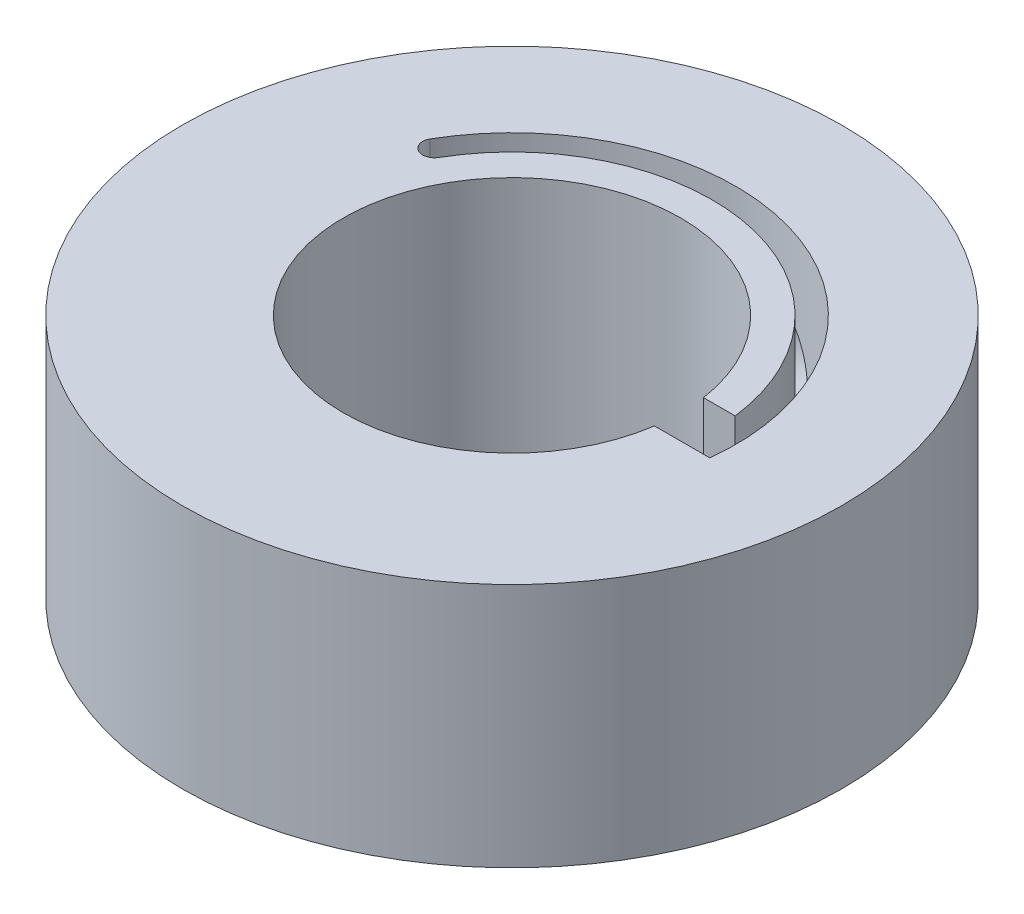
ISO-10303-21;
HEADER;
FILE_DESCRIPTION(('STEP AP214'),'2;1');
FILE_NAME('part.step','',(''),(''),'','','');
FILE_SCHEMA(('AUTOMOTIVE_DESIGN { 1 0 10303 214 1 1 1 1 }'));
ENDSEC;
DATA;
#1=APPLICATION_CONTEXT('core data for automotive mechanical design processes');
#2=APPLICATION_PROTOCOL_DEFINITION('international standard','automotive_design',2000,#1);
#3=PRODUCT_CONTEXT('',#1,'mechanical');
#4=PRODUCT('Part','Part','',(#3));
#5=PRODUCT_RELATED_PRODUCT_CATEGORY('part','',(#4));
#6=PRODUCT_DEFINITION_FORMATION('','',#4);
#7=PRODUCT_DEFINITION_CONTEXT('part definition',#1,'design');
#8=PRODUCT_DEFINITION('design','',#6,#7);
#9=PRODUCT_DEFINITION_SHAPE('','',#8);
#10=(LENGTH_UNIT() NAMED_UNIT(*) SI_UNIT(.MILLI.,.METRE.));
#11=(NAMED_UNIT(*) PLANE_ANGLE_UNIT() SI_UNIT($,.RADIAN.));
#12=(NAMED_UNIT(*) SI_UNIT($,.STERADIAN.) SOLID_ANGLE_UNIT());
#13=UNCERTAINTY_MEASURE_WITH_UNIT(LENGTH_MEASURE(1.E-05),#10,'distance_accuracy_value','');
#14=(GEOMETRIC_REPRESENTATION_CONTEXT(3) GLOBAL_UNCERTAINTY_ASSIGNED_CONTEXT((#13)) GLOBAL_UNIT_ASSIGNED_CONTEXT((#10,
#11,#12)) REPRESENTATION_CONTEXT('',''));
#15=CARTESIAN_POINT('',(0.,0.,0.));
#16=DIRECTION('',(0.,0.,1.));
#17=DIRECTION('',(1.,0.,0.));
#18=AXIS2_PLACEMENT_3D('',#15,#16,#17);
#19=CARTESIAN_POINT('',(0.,7.9375,0.));
#20=DIRECTION('',(0.,1.,0.));
#21=DIRECTION('',(0.,0.,1.));
#22=AXIS2_PLACEMENT_3D('',#19,#20,#21);
#23=PLANE('',#22);
#24=CARTESIAN_POINT('',(0.,7.9375,0.));
#25=DIRECTION('',(0.,1.,0.));
#26=DIRECTION('',(0.,0.,1.));
#27=AXIS2_PLACEMENT_3D('',#24,#25,#26);
#28=CIRCLE('',#27,21.336);
#29=CARTESIAN_POINT('',(0.,7.9375,21.336));
#30=VERTEX_POINT('',#29);
#31=EDGE_CURVE('E53',#30,#30,#28,.T.);
#32=ORIENTED_EDGE('',*,*,#31,.T.);
#33=EDGE_LOOP('',(#32));
#34=FACE_BOUND('',#33,.T.);
#35=CARTESIAN_POINT('',(0.,7.9375,0.));
#36=DIRECTION('',(0.,-1.,0.));
#37=DIRECTION('',(0.,0.,-1.));
#38=AXIS2_PLACEMENT_3D('',#35,#36,#37);
#39=CIRCLE('',#38,12.954);
#40=CARTESIAN_POINT('',(-11.2184930806236,7.9375,-6.47700000000001));
#41=VERTEX_POINT('',#40);
#42=CARTESIAN_POINT('',(12.8563587282714,7.9375,-1.58749999999999));
#43=VERTEX_POINT('',#42);
#44=EDGE_CURVE('E106',#41,#43,#39,.T.);
#45=ORIENTED_EDGE('',*,*,#44,.F.);
#46=CARTESIAN_POINT('',(-11.8784044383074,7.9375,-6.85800000000001));
#47=DIRECTION('',(0.,1.,0.));
#48=DIRECTION('',(0.,0.,1.));
#49=AXIS2_PLACEMENT_3D('',#46,#47,#48);
#50=CIRCLE('',#49,0.762000000000001);
#51=CARTESIAN_POINT('',(-12.5383157959911,7.9375,-7.23900000000002));
#52=VERTEX_POINT('',#51);
#53=EDGE_CURVE('E98',#52,#41,#50,.T.);
#54=ORIENTED_EDGE('',*,*,#53,.F.);
#55=CARTESIAN_POINT('',(0.,7.9375,0.));
#56=DIRECTION('',(0.,1.,0.));
#57=DIRECTION('',(0.,0.,1.));
#58=AXIS2_PLACEMENT_3D('',#55,#56,#57);
#59=CIRCLE('',#58,14.478);
#60=CARTESIAN_POINT('',(14.3907028233509,7.9375,1.5875));
#61=VERTEX_POINT('',#60);
#62=EDGE_CURVE('E128',#61,#52,#59,.T.);
#63=ORIENTED_EDGE('',*,*,#62,.F.);
#64=DIRECTION('',(1.,0.,0.));
#65=VECTOR('',#64,1.);
#66=CARTESIAN_POINT('',(10.8060134994363,7.9375,1.5875));
#67=LINE('',#66,#65);
#68=CARTESIAN_POINT('',(10.8060134994363,7.9375,1.5875));
#69=VERTEX_POINT('',#68);
#70=EDGE_CURVE('E126',#69,#61,#67,.T.);
#71=ORIENTED_EDGE('',*,*,#70,.F.);
#72=CARTESIAN_POINT('',(0.,7.9375,0.));
#73=DIRECTION('',(0.,1.,0.));
#74=DIRECTION('',(0.,0.,1.));
#75=AXIS2_PLACEMENT_3D('',#72,#73,#74);
#76=CIRCLE('',#75,10.922);
#77=CARTESIAN_POINT('',(10.8060134994363,7.9375,-1.5875));
#78=VERTEX_POINT('',#77);
#79=EDGE_CURVE('E121',#78,#69,#76,.T.);
#80=ORIENTED_EDGE('',*,*,#79,.F.);
#81=DIRECTION('',(-1.,0.,0.));
#82=VECTOR('',#81,1.);
#83=CARTESIAN_POINT('',(10.8060134994363,7.9375,-1.5875));
#84=LINE('',#83,#82);
#85=EDGE_CURVE('E119',#43,#78,#84,.T.);
#86=ORIENTED_EDGE('',*,*,#85,.F.);
#87=EDGE_LOOP('',(#45,#54,#63,#71,#80,#86));
#88=FACE_BOUND('',#87,.T.);
#89=ADVANCED_FACE('F39',(#34,#88),#23,.T.);
#90=CARTESIAN_POINT('',(0.,-7.9375,0.));
#91=DIRECTION('',(0.,1.,0.));
#92=DIRECTION('',(0.,0.,1.));
#93=AXIS2_PLACEMENT_3D('',#90,#91,#92);
#94=PLANE('',#93);
#95=CARTESIAN_POINT('',(0.,-7.9375,0.));
#96=DIRECTION('',(0.,1.,0.));
#97=DIRECTION('',(0.,0.,1.));
#98=AXIS2_PLACEMENT_3D('',#95,#96,#97);
#99=CIRCLE('',#98,21.336);
#100=CARTESIAN_POINT('',(0.,-7.9375,21.336));
#101=VERTEX_POINT('',#100);
#102=EDGE_CURVE('E114',#101,#101,#99,.T.);
#103=ORIENTED_EDGE('',*,*,#102,.F.);
#104=EDGE_LOOP('',(#103));
#105=FACE_BOUND('',#104,.T.);
#106=CARTESIAN_POINT('',(-11.8784044383074,-7.9375,-6.85800000000001));
#107=DIRECTION('',(0.,1.,0.));
#108=DIRECTION('',(0.,0.,1.));
#109=AXIS2_PLACEMENT_3D('',#106,#107,#108);
#110=CIRCLE('',#109,0.762000000000001);
#111=CARTESIAN_POINT('',(-12.5383157959911,-7.9375,-7.23900000000002));
#112=VERTEX_POINT('',#111);
#113=CARTESIAN_POINT('',(-11.2184930806236,-7.9375,-6.47700000000001));
#114=VERTEX_POINT('',#113);
#115=EDGE_CURVE('E68',#112,#114,#110,.T.);
#116=ORIENTED_EDGE('',*,*,#115,.T.);
#117=CARTESIAN_POINT('',(0.,-7.9375,0.));
#118=DIRECTION('',(0.,-1.,0.));
#119=DIRECTION('',(0.,0.,-1.));
#120=AXIS2_PLACEMENT_3D('',#117,#118,#119);
#121=CIRCLE('',#120,12.954);
#122=CARTESIAN_POINT('',(12.8563587282714,-7.9375,-1.58749999999999));
#123=VERTEX_POINT('',#122);
#124=EDGE_CURVE('E113',#114,#123,#121,.T.);
#125=ORIENTED_EDGE('',*,*,#124,.T.);
#126=DIRECTION('',(-1.,0.,0.));
#127=VECTOR('',#126,1.);
#128=CARTESIAN_POINT('',(10.8060134994363,-7.9375,-1.5875));
#129=LINE('',#128,#127);
#130=CARTESIAN_POINT('',(10.8060134994363,-7.9375,-1.5875));
#131=VERTEX_POINT('',#130);
#132=EDGE_CURVE('E133',#123,#131,#129,.T.);
#133=ORIENTED_EDGE('',*,*,#132,.T.);
#134=CARTESIAN_POINT('',(0.,-7.9375,0.));
#135=DIRECTION('',(0.,1.,0.));
#136=DIRECTION('',(0.,0.,1.));
#137=AXIS2_PLACEMENT_3D('',#134,#135,#136);
#138=CIRCLE('',#137,10.922);
#139=CARTESIAN_POINT('',(10.8060134994363,-7.9375,1.5875));
#140=VERTEX_POINT('',#139);
#141=EDGE_CURVE('E136',#131,#140,#138,.T.);
#142=ORIENTED_EDGE('',*,*,#141,.T.);
#143=DIRECTION('',(1.,0.,0.));
#144=VECTOR('',#143,1.);
#145=CARTESIAN_POINT('',(10.8060134994363,-7.9375,1.5875));
#146=LINE('',#145,#144);
#147=CARTESIAN_POINT('',(14.3907028233509,-7.9375,1.5875));
#148=VERTEX_POINT('',#147);
#149=EDGE_CURVE('E139',#140,#148,#146,.T.);
#150=ORIENTED_EDGE('',*,*,#149,.T.);
#151=CARTESIAN_POINT('',(0.,-7.9375,0.));
#152=DIRECTION('',(0.,1.,0.));
#153=DIRECTION('',(0.,0.,1.));
#154=AXIS2_PLACEMENT_3D('',#151,#152,#153);
#155=CIRCLE('',#154,14.478);
#156=EDGE_CURVE('E107',#148,#112,#155,.T.);
#157=ORIENTED_EDGE('',*,*,#156,.T.);
#158=EDGE_LOOP('',(#116,#125,#133,#142,#150,#157));
#159=FACE_BOUND('',#158,.T.);
#160=ADVANCED_FACE('F156',(#105,#159),#94,.F.);
#161=CARTESIAN_POINT('',(0.,7.9375,0.));
#162=DIRECTION('',(0.,-1.,0.));
#163=DIRECTION('',(0.,0.,-1.));
#164=AXIS2_PLACEMENT_3D('',#161,#162,#163);
#165=CYLINDRICAL_SURFACE('',#164,21.336);
#166=CARTESIAN_POINT('',(1.08779595963736,0.,-21.3082518276417));
#167=CARTESIAN_POINT('',(1.08780373341579,-0.177278578076983,-21.308253253922));
#168=CARTESIAN_POINT('',(1.10284534938139,-0.354660471648266,-21.3075000050969));
#169=CARTESIAN_POINT('',(1.1625617138382,-0.704466029121983,-21.3043236447995));
#170=CARTESIAN_POINT('',(1.20726547265049,-0.876884666416155,-21.3018988984703));
#171=CARTESIAN_POINT('',(1.32482956117549,-1.21164965988907,-21.2949094182663));
#172=CARTESIAN_POINT('',(1.39766841142168,-1.37400359040746,-21.2903463163333));
#173=CARTESIAN_POINT('',(1.56921713068519,-1.6842537358227,-21.2783883864247));
#174=CARTESIAN_POINT('',(1.66792339382548,-1.83215196188003,-21.2709939530662));
#175=CARTESIAN_POINT('',(1.88902891409907,-2.11048132876311,-21.252501603999));
#176=CARTESIAN_POINT('',(2.01159025057308,-2.24078201984194,-21.2413779543825));
#177=CARTESIAN_POINT('',(2.27634107753049,-2.47908728867893,-21.2146372724705));
#178=CARTESIAN_POINT('',(2.41853164105172,-2.58709064674042,-21.1990199944786));
#179=CARTESIAN_POINT('',(2.71911952937488,-2.7782161006412,-21.1625678490485));
#180=CARTESIAN_POINT('',(2.87759028640593,-2.86121816938316,-21.1417086670087));
#181=CARTESIAN_POINT('',(3.205524671342,-2.99921474123871,-21.09447601415));
#182=CARTESIAN_POINT('',(3.37498772687969,-3.05421070130847,-21.0681028302856));
#183=CARTESIAN_POINT('',(3.71863797992595,-3.13423874817121,-21.0101583054952));
#184=CARTESIAN_POINT('',(3.89278102488143,-3.15948920973926,-20.9786268087397));
#185=CARTESIAN_POINT('',(4.24190428107768,-3.179987493946,-20.910828654112));
#186=CARTESIAN_POINT('',(4.41688444595651,-3.17523695933178,-20.8745622556127));
#187=CARTESIAN_POINT('',(4.76127182411261,-3.13604057237649,-20.7987029536756));
#188=CARTESIAN_POINT('',(4.93071214733013,-3.1018296533621,-20.7591385987547));
#189=CARTESIAN_POINT('',(5.26077136492237,-3.00505231194102,-20.6779612976446));
#190=CARTESIAN_POINT('',(5.42139003506101,-2.94248516912602,-20.6363482994322));
#191=CARTESIAN_POINT('',(5.73007970388413,-2.79053044239289,-20.5527802082825));
#192=CARTESIAN_POINT('',(5.87810173032189,-2.70104381380534,-20.5108244184406));
#193=CARTESIAN_POINT('',(6.1570776850566,-2.49786261188114,-20.4288145694005));
#194=CARTESIAN_POINT('',(6.2880305064551,-2.3841664698714,-20.3887606336401));
#195=CARTESIAN_POINT('',(6.53069598740874,-2.13448453587224,-20.3123430029879));
#196=CARTESIAN_POINT('',(6.64221014513805,-1.99829364615843,-20.2760187800019));
#197=CARTESIAN_POINT('',(6.84153415599213,-1.70818539685168,-20.2096357614095));
#198=CARTESIAN_POINT('',(6.9293438674843,-1.55426793135138,-20.179577003239));
#199=CARTESIAN_POINT('',(7.07899473620095,-1.2328663010627,-20.127569182225));
#200=CARTESIAN_POINT('',(7.14081615862052,-1.06537194105543,-20.1056262838601));
#201=CARTESIAN_POINT('',(7.23670005422282,-0.721684453301879,-20.0713150084781));
#202=CARTESIAN_POINT('',(7.27076445128857,-0.545491929336955,-20.0589459678847));
#203=CARTESIAN_POINT('',(7.30999607006042,-0.191209555980969,-20.0446823783103));
#204=CARTESIAN_POINT('',(7.31543587041267,-0.0131538426097825,-20.0426890284603));
#205=CARTESIAN_POINT('',(7.2980016350079,0.341374970356617,-20.0490436398801));
#206=CARTESIAN_POINT('',(7.27512846342955,0.517848118089873,-20.0573912855184));
#207=CARTESIAN_POINT('',(7.20188720364921,0.863315384599346,-20.0838045314036));
#208=CARTESIAN_POINT('',(7.15165495011748,1.03234202966209,-20.101822115125));
#209=CARTESIAN_POINT('',(7.02513502567655,1.3591436063189,-20.1463854228426));
#210=CARTESIAN_POINT('',(6.94884608673433,1.51691798987663,-20.1729315618721));
#211=CARTESIAN_POINT('',(6.77154055635149,1.81802261718808,-20.2331394467775));
#212=CARTESIAN_POINT('',(6.67034481836758,1.96123709314685,-20.2668524911919));
#213=CARTESIAN_POINT('',(6.44612642215382,2.22796695758023,-20.3392771718327));
#214=CARTESIAN_POINT('',(6.32310254983301,2.35148124959545,-20.3779890860661));
#215=CARTESIAN_POINT('',(6.05728364116986,2.5763334270029,-20.4585830329783));
#216=CARTESIAN_POINT('',(5.9143348806656,2.67748133422547,-20.5004884394655));
#217=CARTESIAN_POINT('',(5.61321580724818,2.85340639091289,-20.5849732124318));
#218=CARTESIAN_POINT('',(5.4550459055223,2.92818425248959,-20.627552560679));
#219=CARTESIAN_POINT('',(5.12837899841847,3.04894247438152,-20.7111786953734));
#220=CARTESIAN_POINT('',(4.95992181959895,3.095027011873,-20.7522305111115));
#221=CARTESIAN_POINT('',(4.61688112568349,3.15742765594605,-20.8312329010639));
#222=CARTESIAN_POINT('',(4.4422980092824,3.17374569617364,-20.8691836765703));
#223=CARTESIAN_POINT('',(4.0937260180294,3.17610351230243,-20.9403353432266));
#224=CARTESIAN_POINT('',(3.91974767846298,3.16243408448427,-20.9735785542003));
#225=CARTESIAN_POINT('',(3.5757010970235,3.10582791452715,-21.0349661915453));
#226=CARTESIAN_POINT('',(3.40563284321553,3.06289126173407,-21.0631106334816));
#227=CARTESIAN_POINT('',(3.07441432953836,2.94907202718885,-21.1139989476336));
#228=CARTESIAN_POINT('',(2.91325783685296,2.87820926599305,-21.1367466318937));
#229=CARTESIAN_POINT('',(2.60432594109808,2.71058030787123,-21.177031895523));
#230=CARTESIAN_POINT('',(2.45655095881284,2.61381329675924,-21.1945693110939));
#231=CARTESIAN_POINT('',(2.17730429657634,2.39606991233675,-21.2250838195239));
#232=CARTESIAN_POINT('',(2.04599534356721,2.27487873341843,-21.2380174142955));
#233=CARTESIAN_POINT('',(1.80510240648608,2.01217902224269,-21.259848769077));
#234=CARTESIAN_POINT('',(1.69552353017702,1.87066572661609,-21.2687455808525));
#235=CARTESIAN_POINT('',(1.50087733971375,1.57042047419265,-21.2833707719457));
#236=CARTESIAN_POINT('',(1.41594878278736,1.41159771266631,-21.2890813758861));
#237=CARTESIAN_POINT('',(1.27416180905052,1.08194383851267,-21.2980397865488));
#238=CARTESIAN_POINT('',(1.21727418966855,0.911125431247561,-21.3012901573206));
#239=CARTESIAN_POINT('',(1.14627516027896,0.616278048781065,-21.3052048990765));
#240=CARTESIAN_POINT('',(1.12438133740149,0.494072278672086,-21.3063577115681));
#241=CARTESIAN_POINT('',(1.09513911055454,0.24792783718268,-21.3078806721292));
#242=CARTESIAN_POINT('',(1.0877905226326,0.123989187737807,-21.3082508300968));
#243=CARTESIAN_POINT('',(1.08779595963736,0.,-21.3082518276417));
#244=B_SPLINE_CURVE_WITH_KNOTS('',3,(#166,#167,#168,#169,#170,#171,#172,#173,#174,#175,#176,
#177,#178,#179,#180,#181,#182,#183,#184,#185,#186,#187,#188,#189,#190,#191,#192,#193,#194,#195,
#196,#197,#198,#199,#200,#201,#202,#203,#204,#205,#206,#207,#208,#209,#210,#211,#212,#213,#214,
#215,#216,#217,#218,#219,#220,#221,#222,#223,#224,#225,#226,#227,#228,#229,#230,#231,#232,#233,
#234,#235,#236,#237,#238,#239,#240,#241,#242,#243),.UNSPECIFIED.,.T.,.F.,(4,2,2,2,2,2,2,2,2,2,2,
2,2,2,2,2,2,2,2,2,2,2,2,2,2,2,2,2,2,2,2,2,2,2,2,2,2,2,4),(0.,0.531382552315151,1.06328557766761,
1.59478332678854,2.12620702532546,2.66137606188306,3.19657436521648,3.73430255271976,
4.27200276323868,4.80573038006776,5.3394287721377,5.86891016105958,6.39840500255482,
6.92987234663618,7.46137413801697,7.99802053638338,8.53467014110801,9.07172653010777,
9.6087456917182,10.1406416934069,10.6725214607755,11.2017842644989,11.7310728281505,
12.2642857420516,12.7975283228048,13.335139670619,13.8727364993557,14.4083699098853,
14.9439685241708,15.4743962772118,16.0048224109904,16.5348727508708,17.0649397525048,
17.5998897479774,18.1349653374576,18.6729969259132,19.2104670039817,19.5821223106826,
19.9537729170576),.UNSPECIFIED.);
#245=CARTESIAN_POINT('',(1.08779595963736,0.,-21.3082518276417));
#246=VERTEX_POINT('',#245);
#247=EDGE_CURVE('E131',#246,#246,#244,.T.);
#248=ORIENTED_EDGE('',*,*,#247,.T.);
#249=EDGE_LOOP('',(#248));
#250=FACE_BOUND('',#249,.T.);
#251=ORIENTED_EDGE('',*,*,#31,.F.);
#252=EDGE_LOOP('',(#251));
#253=FACE_BOUND('',#252,.T.);
#254=ORIENTED_EDGE('',*,*,#102,.T.);
#255=EDGE_LOOP('',(#254));
#256=FACE_BOUND('',#255,.T.);
#257=ADVANCED_FACE('F41',(#250,#253,#256),#165,.T.);
#258=CARTESIAN_POINT('',(-11.8784044383074,7.9375,-6.85800000000001));
#259=DIRECTION('',(0.,-1.,0.));
#260=DIRECTION('',(0.,0.,-1.));
#261=AXIS2_PLACEMENT_3D('',#258,#259,#260);
#262=CYLINDRICAL_SURFACE('',#261,0.762000000000001);
#263=ORIENTED_EDGE('',*,*,#115,.F.);
#264=DIRECTION('',(0.,-1.,0.));
#265=VECTOR('',#264,1.);
#266=CARTESIAN_POINT('',(-12.5383157959911,7.9375,-7.23900000000002));
#267=LINE('',#266,#265);
#268=EDGE_CURVE('E102',#52,#112,#267,.T.);
#269=ORIENTED_EDGE('',*,*,#268,.F.);
#270=ORIENTED_EDGE('',*,*,#53,.T.);
#271=DIRECTION('',(0.,-1.,0.));
#272=VECTOR('',#271,1.);
#273=CARTESIAN_POINT('',(-11.2184930806236,7.9375,-6.47700000000001));
#274=LINE('',#273,#272);
#275=EDGE_CURVE('E101',#41,#114,#274,.T.);
#276=ORIENTED_EDGE('',*,*,#275,.T.);
#277=EDGE_LOOP('',(#263,#269,#270,#276));
#278=FACE_BOUND('',#277,.T.);
#279=ADVANCED_FACE('F100',(#278),#262,.F.);
#280=CARTESIAN_POINT('',(0.,7.9375,0.));
#281=DIRECTION('',(0.,-1.,0.));
#282=DIRECTION('',(0.,0.,-1.));
#283=AXIS2_PLACEMENT_3D('',#280,#281,#282);
#284=CYLINDRICAL_SURFACE('',#283,12.954);
#285=ORIENTED_EDGE('',*,*,#124,.F.);
#286=ORIENTED_EDGE('',*,*,#275,.F.);
#287=ORIENTED_EDGE('',*,*,#44,.T.);
#288=DIRECTION('',(0.,-1.,0.));
#289=VECTOR('',#288,1.);
#290=CARTESIAN_POINT('',(12.8563587282714,7.9375,-1.58749999999999));
#291=LINE('',#290,#289);
#292=EDGE_CURVE('E115',#43,#123,#291,.T.);
#293=ORIENTED_EDGE('',*,*,#292,.T.);
#294=EDGE_LOOP('',(#285,#286,#287,#293));
#295=FACE_BOUND('',#294,.T.);
#296=ADVANCED_FACE('F110',(#295),#284,.T.);
#297=CARTESIAN_POINT('',(10.8060134994363,7.9375,-1.5875));
#298=DIRECTION('',(0.,0.,1.));
#299=DIRECTION('',(1.,0.,0.));
#300=AXIS2_PLACEMENT_3D('',#297,#298,#299);
#301=PLANE('',#300);
#302=ORIENTED_EDGE('',*,*,#132,.F.);
#303=ORIENTED_EDGE('',*,*,#292,.F.);
#304=ORIENTED_EDGE('',*,*,#85,.T.);
#305=DIRECTION('',(0.,-1.,0.));
#306=VECTOR('',#305,1.);
#307=CARTESIAN_POINT('',(10.8060134994363,7.9375,-1.5875));
#308=LINE('',#307,#306);
#309=EDGE_CURVE('E148',#78,#131,#308,.T.);
#310=ORIENTED_EDGE('',*,*,#309,.T.);
#311=EDGE_LOOP('',(#302,#303,#304,#310));
#312=FACE_BOUND('',#311,.T.);
#313=ADVANCED_FACE('F171',(#312),#301,.T.);
#314=CARTESIAN_POINT('',(0.,7.9375,0.));
#315=DIRECTION('',(0.,-1.,0.));
#316=DIRECTION('',(0.,0.,-1.));
#317=AXIS2_PLACEMENT_3D('',#314,#315,#316);
#318=CYLINDRICAL_SURFACE('',#317,10.922);
#319=ORIENTED_EDGE('',*,*,#141,.F.);
#320=ORIENTED_EDGE('',*,*,#309,.F.);
#321=ORIENTED_EDGE('',*,*,#79,.T.);
#322=DIRECTION('',(0.,-1.,0.));
#323=VECTOR('',#322,1.);
#324=CARTESIAN_POINT('',(10.8060134994363,7.9375,1.5875));
#325=LINE('',#324,#323);
#326=EDGE_CURVE('E146',#69,#140,#325,.T.);
#327=ORIENTED_EDGE('',*,*,#326,.T.);
#328=EDGE_LOOP('',(#319,#320,#321,#327));
#329=FACE_BOUND('',#328,.T.);
#330=ADVANCED_FACE('F167',(#329),#318,.F.);
#331=CARTESIAN_POINT('',(10.8060134994363,7.9375,1.5875));
#332=DIRECTION('',(0.,0.,-1.));
#333=DIRECTION('',(-1.,0.,0.));
#334=AXIS2_PLACEMENT_3D('',#331,#332,#333);
#335=PLANE('',#334);
#336=ORIENTED_EDGE('',*,*,#149,.F.);
#337=ORIENTED_EDGE('',*,*,#326,.F.);
#338=ORIENTED_EDGE('',*,*,#70,.T.);
#339=DIRECTION('',(0.,-1.,0.));
#340=VECTOR('',#339,1.);
#341=CARTESIAN_POINT('',(14.3907028233509,7.9375,1.5875));
#342=LINE('',#341,#340);
#343=EDGE_CURVE('E60',#61,#148,#342,.T.);
#344=ORIENTED_EDGE('',*,*,#343,.T.);
#345=EDGE_LOOP('',(#336,#337,#338,#344));
#346=FACE_BOUND('',#345,.T.);
#347=ADVANCED_FACE('F164',(#346),#335,.T.);
#348=CARTESIAN_POINT('',(0.,7.9375,0.));
#349=DIRECTION('',(0.,-1.,0.));
#350=DIRECTION('',(0.,0.,-1.));
#351=AXIS2_PLACEMENT_3D('',#348,#349,#350);
#352=CYLINDRICAL_SURFACE('',#351,14.478);
#353=CARTESIAN_POINT('',(-0.300030585512941,0.,-14.4748908682503));
#354=CARTESIAN_POINT('',(-0.300023960002593,-0.176024890329258,-14.4748931529328));
#355=CARTESIAN_POINT('',(-0.284974191333695,-0.35212225376532,-14.4752270047355));
#356=CARTESIAN_POINT('',(-0.225295117297845,-0.699308248930931,-14.4762766036337));
#357=CARTESIAN_POINT('',(-0.180644498785661,-0.870393178868704,-14.4769926258264));
#358=CARTESIAN_POINT('',(-0.0634012620014854,-1.20248190239615,-14.4779789286792));
#359=CARTESIAN_POINT('',(0.00916060470984081,-1.36349656484024,-14.4782496981762));
#360=CARTESIAN_POINT('',(0.179833605050021,-1.67132333355095,-14.477133517978));
#361=CARTESIAN_POINT('',(0.277944240473658,-1.81813571668781,-14.4757466006061));
#362=CARTESIAN_POINT('',(0.498404002594829,-2.095885638555,-14.4698441032471));
#363=CARTESIAN_POINT('',(0.621099998812589,-2.2265468955458,-14.4652811265264));
#364=CARTESIAN_POINT('',(0.886134515387915,-2.46586563702238,-14.4514645431655));
#365=CARTESIAN_POINT('',(1.02847456609529,-2.57452140556441,-14.4422105709279));
#366=CARTESIAN_POINT('',(1.33029848569936,-2.7678383272635,-14.4175560161446));
#367=CARTESIAN_POINT('',(1.48994769593777,-2.85223365432937,-14.4020914834652));
#368=CARTESIAN_POINT('',(1.82039933337051,-2.99291406101411,-14.3640611713722));
#369=CARTESIAN_POINT('',(1.9912004999094,-3.04920231175382,-14.3414961935196));
#370=CARTESIAN_POINT('',(2.33606121980884,-3.13120153383368,-14.2893394567889));
#371=CARTESIAN_POINT('',(2.51002708802618,-3.15738012160418,-14.259863963821));
#372=CARTESIAN_POINT('',(2.85859064483509,-3.17987904622927,-14.1940967383768));
#373=CARTESIAN_POINT('',(3.03318825847531,-3.17620281605022,-14.1578057900694));
#374=CARTESIAN_POINT('',(3.37492782064674,-3.13944452471924,-14.0802180911381));
#375=CARTESIAN_POINT('',(3.54214621348877,-3.10686650813421,-14.0390175790471));
#376=CARTESIAN_POINT('',(3.8676837857664,-3.01403274461012,-13.9528447274768));
#377=CARTESIAN_POINT('',(4.0260025610784,-2.95377574193094,-13.9078722169451));
#378=CARTESIAN_POINT('',(4.33079177150298,-2.80684928844211,-13.8160150686757));
#379=CARTESIAN_POINT('',(4.47716657791754,-2.71998897826102,-13.7691188071581));
#380=CARTESIAN_POINT('',(4.75321150762193,-2.52246392082242,-13.67628256381));
#381=CARTESIAN_POINT('',(4.88287934025258,-2.41179591488163,-13.6303427138336));
#382=CARTESIAN_POINT('',(5.12498495091571,-2.1670535144788,-13.5411974828382));
#383=CARTESIAN_POINT('',(5.23700564410019,-2.0325379884256,-13.4980693883636));
#384=CARTESIAN_POINT('',(5.43774512720292,-1.74536026031723,-13.4184614428329));
#385=CARTESIAN_POINT('',(5.52646327879227,-1.59269756132106,-13.3819817739062));
#386=CARTESIAN_POINT('',(5.67856704985975,-1.2728707831248,-13.3181536488819));
#387=CARTESIAN_POINT('',(5.74187610580585,-1.10566469589872,-13.2908328306817));
#388=CARTESIAN_POINT('',(5.84102351174411,-0.76190160648423,-13.2475614787633));
#389=CARTESIAN_POINT('',(5.87686624466965,-0.58534610103677,-13.2316091309519));
#390=CARTESIAN_POINT('',(5.91959837097562,-0.231772324108911,-13.2125463400221));
#391=CARTESIAN_POINT('',(5.92706601241942,-0.0548376716483962,-13.2091794449303));
#392=CARTESIAN_POINT('',(5.91443270761476,0.297835252916382,-13.2148407651663));
#393=CARTESIAN_POINT('',(5.8943336659551,0.473573606830182,-13.2238681241721));
#394=CARTESIAN_POINT('',(5.8275559414736,0.816712007432921,-13.2534285807412));
#395=CARTESIAN_POINT('',(5.7811966867836,0.984186437295427,-13.2738233585558));
#396=CARTESIAN_POINT('',(5.66338259026576,1.30846586659872,-13.3245138301651));
#397=CARTESIAN_POINT('',(5.59192533602083,1.46526983866603,-13.3548104757069));
#398=CARTESIAN_POINT('',(5.42441111199004,1.76642949523617,-13.4237307140969));
#399=CARTESIAN_POINT('',(5.3279907308668,1.91055511307,-13.4624758593313));
#400=CARTESIAN_POINT('',(5.11343512171014,2.17983672743781,-13.5454222848702));
#401=CARTESIAN_POINT('',(4.99529718217158,2.3049903516949,-13.5896242462488));
#402=CARTESIAN_POINT('',(4.73767710971694,2.53517481083419,-13.6815904777036));
#403=CARTESIAN_POINT('',(4.59783633951066,2.63978439319471,-13.729405997547));
#404=CARTESIAN_POINT('',(4.30196556439758,2.82289802395401,-13.8249668329645));
#405=CARTESIAN_POINT('',(4.14593631809836,2.90140329490168,-13.872712151722));
#406=CARTESIAN_POINT('',(3.82283014852561,3.02949408194829,-13.9651882453872));
#407=CARTESIAN_POINT('',(3.65583119323495,3.0792633328394,-14.0099365180249));
#408=CARTESIAN_POINT('',(3.31455047378656,3.14904275281368,-14.0945776287703));
#409=CARTESIAN_POINT('',(3.14026977801212,3.16905727188319,-14.1344711758304));
#410=CARTESIAN_POINT('',(2.79321173287033,3.17856265313602,-14.207083945132));
#411=CARTESIAN_POINT('',(2.62047901615498,3.1686823321569,-14.2399356134316));
#412=CARTESIAN_POINT('',(2.2779285260055,3.12008561285462,-14.2987318318413));
#413=CARTESIAN_POINT('',(2.10811069969709,3.08136973815699,-14.3246765073642));
#414=CARTESIAN_POINT('',(1.77683206785508,2.97650291359837,-14.369524227571));
#415=CARTESIAN_POINT('',(1.61534588529146,2.91044157641879,-14.3884498933823));
#416=CARTESIAN_POINT('',(1.30465428157418,2.75284627677856,-14.4199435890646));
#417=CARTESIAN_POINT('',(1.15545006105158,2.66130982780478,-14.4325109979968));
#418=CARTESIAN_POINT('',(0.870750035757546,2.45331459169473,-14.4525103353879));
#419=CARTESIAN_POINT('',(0.735569869401104,2.33641386991365,-14.459839771895));
#420=CARTESIAN_POINT('',(0.486110325415625,2.08189930703784,-14.4703768453422));
#421=CARTESIAN_POINT('',(0.371835997183442,1.94428047648142,-14.4735834876263));
#422=CARTESIAN_POINT('',(0.166273036076753,1.65000910808828,-14.4774161041357));
#423=CARTESIAN_POINT('',(0.0753144022433235,1.49312536310253,-14.4780067709985));
#424=CARTESIAN_POINT('',(-0.0785045614090766,1.1662334617668,-14.4779930518272));
#425=CARTESIAN_POINT('',(-0.141388615122353,0.996236529496395,-14.4773896771469));
#426=CARTESIAN_POINT('',(-0.225840317975317,0.688395016151583,-14.4762839871684));
#427=CARTESIAN_POINT('',(-0.253602496622288,0.552217225164983,-14.4757906110732));
#428=CARTESIAN_POINT('',(-0.290699787209763,0.277374541963628,-14.4750931585577));
#429=CARTESIAN_POINT('',(-0.300035806496358,0.138709772552684,-14.4748890678925));
#430=CARTESIAN_POINT('',(-0.300030585512941,0.,-14.4748908682503));
#431=B_SPLINE_CURVE_WITH_KNOTS('',3,(#353,#354,#355,#356,#357,#358,#359,#360,#361,#362,#363,
#364,#365,#366,#367,#368,#369,#370,#371,#372,#373,#374,#375,#376,#377,#378,#379,#380,#381,#382,
#383,#384,#385,#386,#387,#388,#389,#390,#391,#392,#393,#394,#395,#396,#397,#398,#399,#400,#401,
#402,#403,#404,#405,#406,#407,#408,#409,#410,#411,#412,#413,#414,#415,#416,#417,#418,#419,#420,
#421,#422,#423,#424,#425,#426,#427,#428,#429,#430),.UNSPECIFIED.,.T.,.F.,(4,2,2,2,2,2,2,2,2,2,2,
2,2,2,2,2,2,2,2,2,2,2,2,2,2,2,2,2,2,2,2,2,2,2,2,2,2,2,4),(0.,0.527566292321532,1.05551285503925,
1.58287940455603,2.11023567110782,2.64563534648673,3.18107675519481,3.72217907180535,
4.2632203259017,4.79574041909557,5.32819927936961,5.85155075118189,6.37492596874669,
6.90214764789705,7.42944153659004,7.96776370060116,8.50610060938853,9.04604768904723,
9.58590858879887,10.1147069068063,10.6434686918506,11.1659326583737,11.6884468578283,
12.2190433006262,12.7497060350993,13.290317645883,13.8309039345185,14.3679943680172,
14.9050062739767,15.4308015962347,15.9565873707953,16.480663586703,17.0047909733259,
17.5389123503348,18.0731625640989,18.6146019063145,19.1555828453856,19.5713320273676,
19.9870607364013),.UNSPECIFIED.);
#432=CARTESIAN_POINT('',(-0.300030585512941,0.,-14.4748908682503));
#433=VERTEX_POINT('',#432);
#434=EDGE_CURVE('E11',#433,#433,#431,.T.);
#435=ORIENTED_EDGE('',*,*,#434,.F.);
#436=EDGE_LOOP('',(#435));
#437=FACE_BOUND('',#436,.T.);
#438=ORIENTED_EDGE('',*,*,#156,.F.);
#439=ORIENTED_EDGE('',*,*,#343,.F.);
#440=ORIENTED_EDGE('',*,*,#62,.T.);
#441=ORIENTED_EDGE('',*,*,#268,.T.);
#442=EDGE_LOOP('',(#438,#439,#440,#441));
#443=FACE_BOUND('',#442,.T.);
#444=ADVANCED_FACE('F160',(#437,#443),#352,.F.);
#445=CARTESIAN_POINT('',(2.8114469090816,0.,-13.8429630237683));
#446=DIRECTION('',(0.199032391962853,0.,-0.979992911683317));
#447=DIRECTION('',(-0.979992911683317,0.,-0.199032391962853));
#448=AXIS2_PLACEMENT_3D('',#445,#446,#447);
#449=CYLINDRICAL_SURFACE('',#448,3.175);
#450=ORIENTED_EDGE('',*,*,#434,.T.);
#451=EDGE_LOOP('',(#450));
#452=FACE_BOUND('',#451,.T.);
#453=ORIENTED_EDGE('',*,*,#247,.F.);
#454=EDGE_LOOP('',(#453));
#455=FACE_BOUND('',#454,.T.);
#456=ADVANCED_FACE('F203',(#452,#455),#449,.F.);
#457=CLOSED_SHELL('',(#89,#160,#257,#279,#296,#313,#330,#347,#444,#456));
#458=MANIFOLD_SOLID_BREP('B2',#457);
#459=ADVANCED_BREP_SHAPE_REPRESENTATION('',(#18,#458),#14);
#460=SHAPE_DEFINITION_REPRESENTATION(#9,#459);
ENDSEC;
END-ISO-10303-21;
